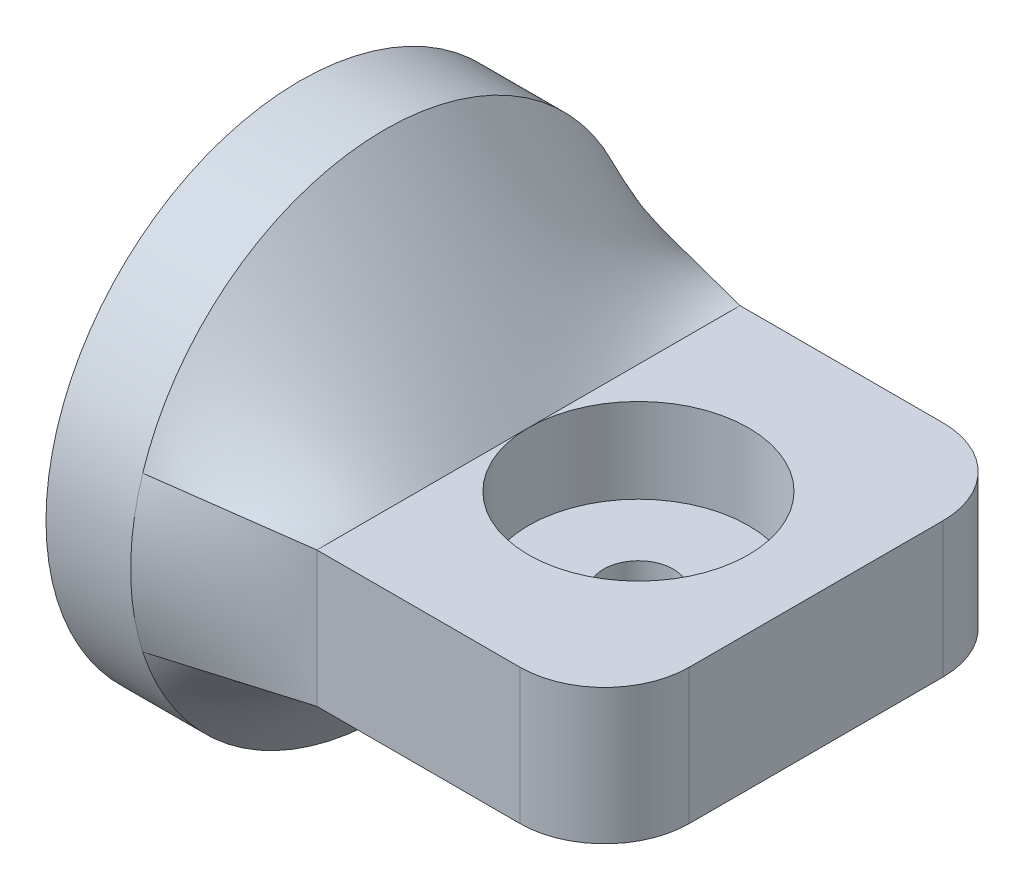
ISO-10303-21;
HEADER;
FILE_DESCRIPTION(('STEP AP214'),'2;1');
FILE_NAME('part.step','',(''),(''),'','','');
FILE_SCHEMA(('AUTOMOTIVE_DESIGN { 1 0 10303 214 1 1 1 1 }'));
ENDSEC;
DATA;
#1=APPLICATION_CONTEXT('core data for automotive mechanical design processes');
#2=APPLICATION_PROTOCOL_DEFINITION('international standard','automotive_design',2000,#1);
#3=PRODUCT_CONTEXT('',#1,'mechanical');
#4=PRODUCT('Part','Part','',(#3));
#5=PRODUCT_RELATED_PRODUCT_CATEGORY('part','',(#4));
#6=PRODUCT_DEFINITION_FORMATION('','',#4);
#7=PRODUCT_DEFINITION_CONTEXT('part definition',#1,'design');
#8=PRODUCT_DEFINITION('design','',#6,#7);
#9=PRODUCT_DEFINITION_SHAPE('','',#8);
#10=(LENGTH_UNIT() NAMED_UNIT(*) SI_UNIT(.MILLI.,.METRE.));
#11=(NAMED_UNIT(*) PLANE_ANGLE_UNIT() SI_UNIT($,.RADIAN.));
#12=(NAMED_UNIT(*) SI_UNIT($,.STERADIAN.) SOLID_ANGLE_UNIT());
#13=UNCERTAINTY_MEASURE_WITH_UNIT(LENGTH_MEASURE(1.E-05),#10,'distance_accuracy_value','');
#14=(GEOMETRIC_REPRESENTATION_CONTEXT(3) GLOBAL_UNCERTAINTY_ASSIGNED_CONTEXT((#13)) GLOBAL_UNIT_ASSIGNED_CONTEXT((#10,
#11,#12)) REPRESENTATION_CONTEXT('',''));
#15=CARTESIAN_POINT('',(0.,0.,0.));
#16=DIRECTION('',(0.,0.,1.));
#17=DIRECTION('',(1.,0.,0.));
#18=AXIS2_PLACEMENT_3D('',#15,#16,#17);
#19=CARTESIAN_POINT('',(0.,4.57163590655676,-14.2863622079899));
#20=CARTESIAN_POINT('',(8.5,4.,-12.5));
#21=CARTESIAN_POINT('',(0.,5.7055256017672,-13.9235175055225));
#22=CARTESIAN_POINT('',(8.5,4.,-11.4583333333333));
#23=CARTESIAN_POINT('',(0.,6.89911447888173,-13.3930431232643));
#24=CARTESIAN_POINT('',(8.5,4.,-10.4166666666667));
#25=CARTESIAN_POINT('',(0.,8.67336070378015,-12.2582894514571));
#26=CARTESIAN_POINT('',(8.5,4.,-8.85416666666664));
#27=CARTESIAN_POINT('',(0.,9.26122646128502,-11.8237084216677));
#28=CARTESIAN_POINT('',(8.5,4.,-8.3333333333333));
#29=CARTESIAN_POINT('',(0.,10.4020192769266,-10.8336693400836));
#30=CARTESIAN_POINT('',(8.5,4.,-7.29166666666663));
#31=CARTESIAN_POINT('',(0.,10.9548679631655,-10.2780926705076));
#32=CARTESIAN_POINT('',(8.5,4.,-6.77083333333329));
#33=CARTESIAN_POINT('',(0.,11.9921816174558,-9.0463197537942));
#34=CARTESIAN_POINT('',(8.5,4.,-5.72916666666662));
#35=CARTESIAN_POINT('',(0.,12.4764973655237,-8.37003816509403));
#36=CARTESIAN_POINT('',(8.5,4.,-5.20833333333329));
#37=CARTESIAN_POINT('',(0.,13.3411278419852,-6.90903996955136));
#38=CARTESIAN_POINT('',(8.5,4.,-4.16666666666661));
#39=CARTESIAN_POINT('',(0.,13.7212416445136,-6.1243184411742));
#40=CARTESIAN_POINT('',(8.5,4.,-3.64583333333328));
#41=CARTESIAN_POINT('',(0.,14.3450405533472,-4.47208677899548));
#42=CARTESIAN_POINT('',(8.5,4.,-2.60416666666661));
#43=CARTESIAN_POINT('',(0.,14.588526725894,-3.60468363324245));
#44=CARTESIAN_POINT('',(8.5,4.,-2.08333333333327));
#45=CARTESIAN_POINT('',(0.,14.9160691770496,-1.82475654084594));
#46=CARTESIAN_POINT('',(8.5,4.,-1.0416666666666));
#47=CARTESIAN_POINT('',(0.,15.,-0.912440474840668));
#48=CARTESIAN_POINT('',(8.5,4.,-0.520833333333269));
#49=CARTESIAN_POINT('',(0.,15.,0.912440474840669));
#50=CARTESIAN_POINT('',(8.5,4.,0.520833333333398));
#51=CARTESIAN_POINT('',(0.,14.9160691770496,1.82475654084594));
#52=CARTESIAN_POINT('',(8.5,4.,1.04166666666673));
#53=CARTESIAN_POINT('',(0.,14.588526725894,3.60468363324245));
#54=CARTESIAN_POINT('',(8.5,4.,2.0833333333334));
#55=CARTESIAN_POINT('',(0.,14.3450405533472,4.47208677899549));
#56=CARTESIAN_POINT('',(8.5,4.,2.60416666666673));
#57=CARTESIAN_POINT('',(0.,13.7212416445136,6.1243184411742));
#58=CARTESIAN_POINT('',(8.5,4.,3.6458333333334));
#59=CARTESIAN_POINT('',(0.,13.3411278419852,6.90903996955136));
#60=CARTESIAN_POINT('',(8.5,4.,4.16666666666673));
#61=CARTESIAN_POINT('',(0.,12.4764973655237,8.37003816509402));
#62=CARTESIAN_POINT('',(8.5,4.,5.20833333333339));
#63=CARTESIAN_POINT('',(0.,11.9921816174558,9.04631975379419));
#64=CARTESIAN_POINT('',(8.5,4.,5.72916666666672));
#65=CARTESIAN_POINT('',(0.,10.9548679631655,10.2780926705076));
#66=CARTESIAN_POINT('',(8.5,4.,6.77083333333338));
#67=CARTESIAN_POINT('',(0.,10.4020192769266,10.8336693400836));
#68=CARTESIAN_POINT('',(8.5,4.,7.29166666666671));
#69=CARTESIAN_POINT('',(0.,9.26122646128502,11.8237084216677));
#70=CARTESIAN_POINT('',(8.5,4.,8.33333333333337));
#71=CARTESIAN_POINT('',(0.,8.67336070378015,12.2582894514571));
#72=CARTESIAN_POINT('',(8.5,4.,8.85416666666671));
#73=CARTESIAN_POINT('',(0.,6.89911447888173,13.3930431232642));
#74=CARTESIAN_POINT('',(8.5,4.,10.4166666666667));
#75=CARTESIAN_POINT('',(0.,5.7055256017672,13.9235175055225));
#76=CARTESIAN_POINT('',(8.5,4.,11.4583333333333));
#77=CARTESIAN_POINT('',(0.,4.57163590655676,14.2863622079899));
#78=CARTESIAN_POINT('',(8.5,4.,12.5));
#79=B_SPLINE_SURFACE_WITH_KNOTS('',3,1,((#19,#20),(#21,#22),(#23,#24),(#25,#26),(#27,#28),(#29,
#30),(#31,#32),(#33,#34),(#35,#36),(#37,#38),(#39,#40),(#41,#42),(#43,#44),(#45,#46),(#47,#48),
(#49,#50),(#51,#52),(#53,#54),(#55,#56),(#57,#58),(#59,#60),(#61,#62),(#63,#64),(#65,#66),(#67,
#68),(#69,#70),(#71,#72),(#73,#74),(#75,#76),(#77,#78)),.UNSPECIFIED.,.F.,.F.,.F.,(4,2,2,2,2,2,
2,2,2,2,2,2,2,2,4),(2,2),(0.,0.125,0.1875,0.25,0.3125,0.375,0.4375,0.5,0.5625,0.625,0.6875,0.75,
0.8125,0.875,1.),(0.,1.),.UNSPECIFIED.);
#80=CARTESIAN_POINT('',(0.,0.,0.));
#81=DIRECTION('',(1.,0.,0.));
#82=DIRECTION('',(0.,0.,-1.));
#83=AXIS2_PLACEMENT_3D('',#80,#81,#82);
#84=CIRCLE('',#83,15.);
#85=CARTESIAN_POINT('',(0.,4.57182275983477,-14.2869402435558));
#86=VERTEX_POINT('',#85);
#87=CARTESIAN_POINT('',(0.,4.57183334503121,14.2869729234421));
#88=VERTEX_POINT('',#87);
#89=EDGE_CURVE('E141',#86,#88,#84,.T.);
#90=DIRECTION('',(0.976509386412931,-0.0656715092192166,-0.20522346631005));
#91=VECTOR('',#90,1.);
#92=CARTESIAN_POINT('',(4.25,4.28581795327838,13.3931811039949));
#93=LINE('',#92,#91);
#94=CARTESIAN_POINT('',(8.5,4.,12.5));
#95=VERTEX_POINT('',#94);
#96=EDGE_CURVE('E162',#88,#95,#93,.T.);
#97=DIRECTION('',(0.,0.,1.));
#98=VECTOR('',#97,1.);
#99=CARTESIAN_POINT('',(8.5,4.,12.5));
#100=LINE('',#99,#98);
#101=CARTESIAN_POINT('',(8.5,4.,0.));
#102=VERTEX_POINT('',#101);
#103=EDGE_CURVE('E312',#102,#95,#100,.T.);
#104=CARTESIAN_POINT('',(8.5,4.,-12.5));
#105=VERTEX_POINT('',#104);
#106=EDGE_CURVE('E273',#105,#102,#100,.T.);
#107=DIRECTION('',(-0.976509386412931,0.065671509219216,-0.20522346631005));
#108=VECTOR('',#107,1.);
#109=CARTESIAN_POINT('',(4.25,4.28581795327838,-13.3931811039949));
#110=LINE('',#109,#108);
#111=EDGE_CURVE('E165',#105,#86,#110,.T.);
#112=ORIENTED_EDGE('',*,*,#89,.T.);
#113=ORIENTED_EDGE('',*,*,#96,.T.);
#114=ORIENTED_EDGE('',*,*,#103,.F.);
#115=ORIENTED_EDGE('',*,*,#106,.F.);
#116=ORIENTED_EDGE('',*,*,#111,.T.);
#117=EDGE_LOOP('',(#112,#113,#114,#115,#116));
#118=FACE_BOUND('',#117,.T.);
#119=ADVANCED_FACE('F68',(#118),#79,.T.);
#120=CARTESIAN_POINT('',(0.,4.57163590655675,14.2863622079899));
#121=CARTESIAN_POINT('',(8.5,4.,12.5));
#122=CARTESIAN_POINT('',(0.,3.84594650162207,14.518582817569));
#123=CARTESIAN_POINT('',(8.5,3.33333333333333,12.5));
#124=CARTESIAN_POINT('',(0.,3.09372515234938,14.6979828288197));
#125=CARTESIAN_POINT('',(8.5,2.66666666666667,12.5));
#126=CARTESIAN_POINT('',(0.,1.56095463943546,14.9387166506424));
#127=CARTESIAN_POINT('',(8.5,1.33333333333333,12.5));
#128=CARTESIAN_POINT('',(0.,0.780505935508361,15.));
#129=CARTESIAN_POINT('',(8.5,0.666666666666664,12.5));
#130=CARTESIAN_POINT('',(0.,-0.780505935508356,15.));
#131=CARTESIAN_POINT('',(8.5,-0.666666666666669,12.5));
#132=CARTESIAN_POINT('',(0.,-1.56095463943546,14.9387166506425));
#133=CARTESIAN_POINT('',(8.5,-1.33333333333334,12.5));
#134=CARTESIAN_POINT('',(0.,-3.09372515234938,14.6979828288197));
#135=CARTESIAN_POINT('',(8.5,-2.66666666666667,12.5));
#136=CARTESIAN_POINT('',(0.,-3.84594650162206,14.518582817569));
#137=CARTESIAN_POINT('',(8.5,-3.33333333333333,12.5));
#138=CARTESIAN_POINT('',(0.,-4.57163590655675,14.2863622079899));
#139=CARTESIAN_POINT('',(8.5,-4.,12.5));
#140=B_SPLINE_SURFACE_WITH_KNOTS('',3,1,((#120,#121),(#122,#123),(#124,#125),(#126,#127),(#128,
#129),(#130,#131),(#132,#133),(#134,#135),(#136,#137),(#138,#139)),.UNSPECIFIED.,.F.,.F.,.F.,(4,
2,2,2,4),(2,2),(0.,0.25,0.5,0.75,1.),(0.,1.),.UNSPECIFIED.);
#141=CARTESIAN_POINT('',(0.,-4.5718211235196,14.2869352396566));
#142=VERTEX_POINT('',#141);
#143=EDGE_CURVE('E137',#88,#142,#84,.T.);
#144=DIRECTION('',(0.976509386412931,0.0656715092192154,-0.205223466310051));
#145=VECTOR('',#144,1.);
#146=CARTESIAN_POINT('',(4.25,-4.28581795327838,13.3931811039949));
#147=LINE('',#146,#145);
#148=CARTESIAN_POINT('',(8.5,-4.,12.5));
#149=VERTEX_POINT('',#148);
#150=EDGE_CURVE('E175',#142,#149,#147,.T.);
#151=DIRECTION('',(0.,-1.,0.));
#152=VECTOR('',#151,1.);
#153=CARTESIAN_POINT('',(8.5,-4.,12.5));
#154=LINE('',#153,#152);
#155=EDGE_CURVE('E172',#95,#149,#154,.T.);
#156=ORIENTED_EDGE('',*,*,#143,.T.);
#157=ORIENTED_EDGE('',*,*,#150,.T.);
#158=ORIENTED_EDGE('',*,*,#155,.F.);
#159=ORIENTED_EDGE('',*,*,#96,.F.);
#160=EDGE_LOOP('',(#156,#157,#158,#159));
#161=FACE_BOUND('',#160,.T.);
#162=ADVANCED_FACE('F170',(#161),#140,.T.);
#163=CARTESIAN_POINT('',(0.,-4.57163590655676,-14.2863622079899));
#164=CARTESIAN_POINT('',(8.5,-4.,-12.5));
#165=CARTESIAN_POINT('',(0.,-3.84594650162207,-14.518582817569));
#166=CARTESIAN_POINT('',(8.5,-3.33333333333333,-12.5));
#167=CARTESIAN_POINT('',(0.,-3.09372515234939,-14.6979828288197));
#168=CARTESIAN_POINT('',(8.5,-2.66666666666667,-12.5));
#169=CARTESIAN_POINT('',(0.,-1.56095463943547,-14.9387166506424));
#170=CARTESIAN_POINT('',(8.5,-1.33333333333333,-12.5));
#171=CARTESIAN_POINT('',(0.,-0.780505935508362,-15.));
#172=CARTESIAN_POINT('',(8.5,-0.666666666666665,-12.5));
#173=CARTESIAN_POINT('',(0.,0.780505935508358,-15.));
#174=CARTESIAN_POINT('',(8.5,0.666666666666668,-12.5));
#175=CARTESIAN_POINT('',(0.,1.56095463943546,-14.9387166506424));
#176=CARTESIAN_POINT('',(8.5,1.33333333333333,-12.5));
#177=CARTESIAN_POINT('',(0.,3.09372515234938,-14.6979828288197));
#178=CARTESIAN_POINT('',(8.5,2.66666666666667,-12.5));
#179=CARTESIAN_POINT('',(0.,3.84594650162207,-14.518582817569));
#180=CARTESIAN_POINT('',(8.5,3.33333333333333,-12.5));
#181=CARTESIAN_POINT('',(0.,4.57163590655676,-14.2863622079899));
#182=CARTESIAN_POINT('',(8.5,4.,-12.5));
#183=B_SPLINE_SURFACE_WITH_KNOTS('',3,1,((#163,#164),(#165,#166),(#167,#168),(#169,#170),(#171,
#172),(#173,#174),(#175,#176),(#177,#178),(#179,#180),(#181,#182)),.UNSPECIFIED.,.F.,.F.,.F.,(4,
2,2,2,4),(2,2),(0.,0.25,0.5,0.75,1.),(0.,1.),.UNSPECIFIED.);
#184=CARTESIAN_POINT('',(0.,-4.57183170509388,-14.2869679122693));
#185=VERTEX_POINT('',#184);
#186=EDGE_CURVE('E72',#185,#86,#84,.T.);
#187=DIRECTION('',(0.,1.,0.));
#188=VECTOR('',#187,1.);
#189=CARTESIAN_POINT('',(8.5,-4.,-12.5));
#190=LINE('',#189,#188);
#191=CARTESIAN_POINT('',(8.5,-4.,-12.5));
#192=VERTEX_POINT('',#191);
#193=EDGE_CURVE('E304',#192,#105,#190,.T.);
#194=DIRECTION('',(0.976509386412931,0.0656715092192168,0.20522346631005));
#195=VECTOR('',#194,1.);
#196=CARTESIAN_POINT('',(4.25,-4.28581795327838,-13.3931811039949));
#197=LINE('',#196,#195);
#198=EDGE_CURVE('E179',#185,#192,#197,.T.);
#199=ORIENTED_EDGE('',*,*,#186,.T.);
#200=ORIENTED_EDGE('',*,*,#111,.F.);
#201=ORIENTED_EDGE('',*,*,#193,.F.);
#202=ORIENTED_EDGE('',*,*,#198,.F.);
#203=EDGE_LOOP('',(#199,#200,#201,#202));
#204=FACE_BOUND('',#203,.T.);
#205=ADVANCED_FACE('F204',(#204),#183,.T.);
#206=CARTESIAN_POINT('',(0.,-4.57163590655675,14.2863622079899));
#207=CARTESIAN_POINT('',(8.5,-4.,12.5));
#208=CARTESIAN_POINT('',(0.,-5.7055256017672,13.9235175055225));
#209=CARTESIAN_POINT('',(8.5,-4.,11.4583333333333));
#210=CARTESIAN_POINT('',(0.,-6.89911447888173,13.3930431232643));
#211=CARTESIAN_POINT('',(8.5,-4.,10.4166666666667));
#212=CARTESIAN_POINT('',(0.,-8.67336070378015,12.2582894514571));
#213=CARTESIAN_POINT('',(8.5,-4.,8.85416666666666));
#214=CARTESIAN_POINT('',(0.,-9.26122646128502,11.8237084216677));
#215=CARTESIAN_POINT('',(8.5,-4.,8.33333333333333));
#216=CARTESIAN_POINT('',(0.,-10.4020192769266,10.8336693400837));
#217=CARTESIAN_POINT('',(8.5,-4.,7.29166666666666));
#218=CARTESIAN_POINT('',(0.,-10.9548679631655,10.2780926705076));
#219=CARTESIAN_POINT('',(8.5,-4.,6.77083333333333));
#220=CARTESIAN_POINT('',(0.,-11.9921816174558,9.0463197537942));
#221=CARTESIAN_POINT('',(8.5,-4.,5.72916666666666));
#222=CARTESIAN_POINT('',(0.,-12.4764973655237,8.37003816509403));
#223=CARTESIAN_POINT('',(8.5,-4.,5.20833333333333));
#224=CARTESIAN_POINT('',(0.,-13.3411278419852,6.90903996955137));
#225=CARTESIAN_POINT('',(8.5,-4.,4.16666666666666));
#226=CARTESIAN_POINT('',(0.,-13.7212416445136,6.1243184411742));
#227=CARTESIAN_POINT('',(8.5,-4.,3.64583333333332));
#228=CARTESIAN_POINT('',(0.,-14.3450405533472,4.47208677899549));
#229=CARTESIAN_POINT('',(8.5,-4.,2.60416666666666));
#230=CARTESIAN_POINT('',(0.,-14.588526725894,3.60468363324246));
#231=CARTESIAN_POINT('',(8.5,-4.,2.08333333333332));
#232=CARTESIAN_POINT('',(0.,-14.9160691770496,1.82475654084595));
#233=CARTESIAN_POINT('',(8.5,-4.,1.04166666666666));
#234=CARTESIAN_POINT('',(0.,-15.,0.912440474840675));
#235=CARTESIAN_POINT('',(8.5,-4.,0.520833333333325));
#236=CARTESIAN_POINT('',(0.,-15.,-0.912440474840661));
#237=CARTESIAN_POINT('',(8.5,-4.,-0.520833333333344));
#238=CARTESIAN_POINT('',(0.,-14.9160691770496,-1.82475654084594));
#239=CARTESIAN_POINT('',(8.5,-4.,-1.04166666666668));
#240=CARTESIAN_POINT('',(0.,-14.588526725894,-3.60468363324244));
#241=CARTESIAN_POINT('',(8.5,-4.,-2.08333333333335));
#242=CARTESIAN_POINT('',(0.,-14.3450405533472,-4.47208677899548));
#243=CARTESIAN_POINT('',(8.5,-4.,-2.60416666666668));
#244=CARTESIAN_POINT('',(0.,-13.7212416445136,-6.12431844117419));
#245=CARTESIAN_POINT('',(8.5,-4.,-3.64583333333335));
#246=CARTESIAN_POINT('',(0.,-13.3411278419852,-6.90903996955135));
#247=CARTESIAN_POINT('',(8.5,-4.,-4.16666666666668));
#248=CARTESIAN_POINT('',(0.,-12.4764973655237,-8.37003816509402));
#249=CARTESIAN_POINT('',(8.5,-4.,-5.20833333333335));
#250=CARTESIAN_POINT('',(0.,-11.9921816174558,-9.04631975379419));
#251=CARTESIAN_POINT('',(8.5,-4.,-5.72916666666668));
#252=CARTESIAN_POINT('',(0.,-10.9548679631655,-10.2780926705076));
#253=CARTESIAN_POINT('',(8.5,-4.,-6.77083333333335));
#254=CARTESIAN_POINT('',(0.,-10.4020192769266,-10.8336693400836));
#255=CARTESIAN_POINT('',(8.5,-4.,-7.29166666666668));
#256=CARTESIAN_POINT('',(0.,-9.26122646128503,-11.8237084216677));
#257=CARTESIAN_POINT('',(8.5,-4.,-8.33333333333334));
#258=CARTESIAN_POINT('',(0.,-8.67336070378015,-12.2582894514571));
#259=CARTESIAN_POINT('',(8.5,-4.,-8.85416666666668));
#260=CARTESIAN_POINT('',(0.,-6.89911447888174,-13.3930431232642));
#261=CARTESIAN_POINT('',(8.5,-4.,-10.4166666666667));
#262=CARTESIAN_POINT('',(0.,-5.70552560176721,-13.9235175055225));
#263=CARTESIAN_POINT('',(8.5,-4.,-11.4583333333333));
#264=CARTESIAN_POINT('',(0.,-4.57163590655676,-14.2863622079899));
#265=CARTESIAN_POINT('',(8.5,-4.,-12.5));
#266=B_SPLINE_SURFACE_WITH_KNOTS('',3,1,((#206,#207),(#208,#209),(#210,#211),(#212,#213),(#214,
#215),(#216,#217),(#218,#219),(#220,#221),(#222,#223),(#224,#225),(#226,#227),(#228,#229),(#230,
#231),(#232,#233),(#234,#235),(#236,#237),(#238,#239),(#240,#241),(#242,#243),(#244,#245),(#246,
#247),(#248,#249),(#250,#251),(#252,#253),(#254,#255),(#256,#257),(#258,#259),(#260,#261),(#262,
#263),(#264,#265)),.UNSPECIFIED.,.F.,.F.,.F.,(4,2,2,2,2,2,2,2,2,2,2,2,2,2,4),(2,2),(0.,0.125,
0.1875,0.25,0.3125,0.375,0.4375,0.5,0.5625,0.625,0.6875,0.75,0.8125,0.875,1.),(0.,1.),.UNSPECIFIED.);
#267=EDGE_CURVE('E145',#142,#185,#84,.T.);
#268=DIRECTION('',(0.,0.,-1.));
#269=VECTOR('',#268,1.);
#270=CARTESIAN_POINT('',(8.5,-4.,12.5));
#271=LINE('',#270,#269);
#272=EDGE_CURVE('E233',#149,#192,#271,.T.);
#273=ORIENTED_EDGE('',*,*,#267,.T.);
#274=ORIENTED_EDGE('',*,*,#198,.T.);
#275=ORIENTED_EDGE('',*,*,#272,.F.);
#276=ORIENTED_EDGE('',*,*,#150,.F.);
#277=EDGE_LOOP('',(#273,#274,#275,#276));
#278=FACE_BOUND('',#277,.T.);
#279=ADVANCED_FACE('F296',(#278),#266,.T.);
#280=CARTESIAN_POINT('',(25.5,-4.,-12.5));
#281=DIRECTION('',(0.,0.,1.));
#282=DIRECTION('',(1.,0.,0.));
#283=AXIS2_PLACEMENT_3D('',#280,#281,#282);
#284=PLANE('',#283);
#285=DIRECTION('',(-1.,0.,0.));
#286=VECTOR('',#285,1.);
#287=CARTESIAN_POINT('',(25.5,4.,-12.5));
#288=LINE('',#287,#286);
#289=CARTESIAN_POINT('',(20.5,4.,-12.5));
#290=VERTEX_POINT('',#289);
#291=EDGE_CURVE('E153',#290,#105,#288,.T.);
#292=ORIENTED_EDGE('',*,*,#291,.F.);
#293=DIRECTION('',(0.,1.,0.));
#294=VECTOR('',#293,1.);
#295=CARTESIAN_POINT('',(20.5,-4.,-12.5));
#296=LINE('',#295,#294);
#297=CARTESIAN_POINT('',(20.5,-4.,-12.5));
#298=VERTEX_POINT('',#297);
#299=EDGE_CURVE('E12',#290,#298,#296,.F.);
#300=ORIENTED_EDGE('',*,*,#299,.T.);
#301=DIRECTION('',(-1.,0.,0.));
#302=VECTOR('',#301,1.);
#303=CARTESIAN_POINT('',(25.5,-4.,-12.5));
#304=LINE('',#303,#302);
#305=EDGE_CURVE('E252',#298,#192,#304,.T.);
#306=ORIENTED_EDGE('',*,*,#305,.T.);
#307=ORIENTED_EDGE('',*,*,#193,.T.);
#308=EDGE_LOOP('',(#292,#300,#306,#307));
#309=FACE_BOUND('',#308,.T.);
#310=ADVANCED_FACE('F292',(#309),#284,.F.);
#311=CARTESIAN_POINT('',(25.5,4.,12.5));
#312=DIRECTION('',(0.,-1.,0.));
#313=DIRECTION('',(0.,0.,-1.));
#314=AXIS2_PLACEMENT_3D('',#311,#312,#313);
#315=PLANE('',#314);
#316=ORIENTED_EDGE('',*,*,#106,.T.);
#317=CARTESIAN_POINT('',(15.,4.,0.));
#318=DIRECTION('',(0.,1.,0.));
#319=DIRECTION('',(0.,0.,1.));
#320=AXIS2_PLACEMENT_3D('',#317,#318,#319);
#321=CIRCLE('',#320,6.5);
#322=EDGE_CURVE('E85',#102,#102,#321,.T.);
#323=ORIENTED_EDGE('',*,*,#322,.F.);
#324=ORIENTED_EDGE('',*,*,#103,.T.);
#325=DIRECTION('',(-1.,0.,0.));
#326=VECTOR('',#325,1.);
#327=CARTESIAN_POINT('',(25.5,4.,12.5));
#328=LINE('',#327,#326);
#329=CARTESIAN_POINT('',(20.5,4.,12.5));
#330=VERTEX_POINT('',#329);
#331=EDGE_CURVE('E251',#330,#95,#328,.T.);
#332=ORIENTED_EDGE('',*,*,#331,.F.);
#333=CARTESIAN_POINT('',(20.5,4.,7.5));
#334=DIRECTION('',(0.,-1.,0.));
#335=DIRECTION('',(0.,0.,-1.));
#336=AXIS2_PLACEMENT_3D('',#333,#334,#335);
#337=CIRCLE('',#336,5.);
#338=CARTESIAN_POINT('',(25.5,4.,7.5));
#339=VERTEX_POINT('',#338);
#340=EDGE_CURVE('E79',#330,#339,#337,.F.);
#341=ORIENTED_EDGE('',*,*,#340,.T.);
#342=DIRECTION('',(0.,0.,1.));
#343=VECTOR('',#342,1.);
#344=CARTESIAN_POINT('',(25.5,4.,12.5));
#345=LINE('',#344,#343);
#346=CARTESIAN_POINT('',(25.5,4.,-7.5));
#347=VERTEX_POINT('',#346);
#348=EDGE_CURVE('E413',#347,#339,#345,.T.);
#349=ORIENTED_EDGE('',*,*,#348,.F.);
#350=CARTESIAN_POINT('',(20.5,4.,-7.5));
#351=DIRECTION('',(0.,-1.,0.));
#352=DIRECTION('',(0.,0.,-1.));
#353=AXIS2_PLACEMENT_3D('',#350,#351,#352);
#354=CIRCLE('',#353,5.);
#355=EDGE_CURVE('E92',#347,#290,#354,.F.);
#356=ORIENTED_EDGE('',*,*,#355,.T.);
#357=ORIENTED_EDGE('',*,*,#291,.T.);
#358=EDGE_LOOP('',(#316,#323,#324,#332,#341,#349,#356,#357));
#359=FACE_BOUND('',#358,.T.);
#360=ADVANCED_FACE('F281',(#359),#315,.F.);
#361=CARTESIAN_POINT('',(25.5,-4.,12.5));
#362=DIRECTION('',(0.,0.,-1.));
#363=DIRECTION('',(-1.,0.,0.));
#364=AXIS2_PLACEMENT_3D('',#361,#362,#363);
#365=PLANE('',#364);
#366=DIRECTION('',(-1.,0.,0.));
#367=VECTOR('',#366,1.);
#368=CARTESIAN_POINT('',(25.5,-4.,12.5));
#369=LINE('',#368,#367);
#370=CARTESIAN_POINT('',(20.5,-4.,12.5));
#371=VERTEX_POINT('',#370);
#372=EDGE_CURVE('E247',#371,#149,#369,.T.);
#373=ORIENTED_EDGE('',*,*,#372,.F.);
#374=DIRECTION('',(0.,-1.,0.));
#375=VECTOR('',#374,1.);
#376=CARTESIAN_POINT('',(20.5,-4.,12.5));
#377=LINE('',#376,#375);
#378=EDGE_CURVE('E262',#371,#330,#377,.F.);
#379=ORIENTED_EDGE('',*,*,#378,.T.);
#380=ORIENTED_EDGE('',*,*,#331,.T.);
#381=ORIENTED_EDGE('',*,*,#155,.T.);
#382=EDGE_LOOP('',(#373,#379,#380,#381));
#383=FACE_BOUND('',#382,.T.);
#384=ADVANCED_FACE('F291',(#383),#365,.F.);
#385=CARTESIAN_POINT('',(25.5,-4.,12.5));
#386=DIRECTION('',(0.,1.,0.));
#387=DIRECTION('',(0.,0.,1.));
#388=AXIS2_PLACEMENT_3D('',#385,#386,#387);
#389=PLANE('',#388);
#390=CARTESIAN_POINT('',(15.,-4.,0.));
#391=DIRECTION('',(0.,1.,0.));
#392=DIRECTION('',(0.,0.,1.));
#393=AXIS2_PLACEMENT_3D('',#390,#391,#392);
#394=CIRCLE('',#393,2.05);
#395=CARTESIAN_POINT('',(15.,-4.,2.05));
#396=VERTEX_POINT('',#395);
#397=EDGE_CURVE('E579',#396,#396,#394,.T.);
#398=ORIENTED_EDGE('',*,*,#397,.T.);
#399=EDGE_LOOP('',(#398));
#400=FACE_BOUND('',#399,.T.);
#401=DIRECTION('',(0.,0.,-1.));
#402=VECTOR('',#401,1.);
#403=CARTESIAN_POINT('',(25.5,-4.,12.5));
#404=LINE('',#403,#402);
#405=CARTESIAN_POINT('',(25.5,-4.,7.5));
#406=VERTEX_POINT('',#405);
#407=CARTESIAN_POINT('',(25.5,-4.,-7.5));
#408=VERTEX_POINT('',#407);
#409=EDGE_CURVE('E327',#406,#408,#404,.T.);
#410=ORIENTED_EDGE('',*,*,#409,.F.);
#411=CARTESIAN_POINT('',(20.5,-4.,7.5));
#412=DIRECTION('',(0.,1.,0.));
#413=DIRECTION('',(0.,0.,1.));
#414=AXIS2_PLACEMENT_3D('',#411,#412,#413);
#415=CIRCLE('',#414,5.);
#416=EDGE_CURVE('E258',#406,#371,#415,.F.);
#417=ORIENTED_EDGE('',*,*,#416,.T.);
#418=ORIENTED_EDGE('',*,*,#372,.T.);
#419=ORIENTED_EDGE('',*,*,#272,.T.);
#420=ORIENTED_EDGE('',*,*,#305,.F.);
#421=CARTESIAN_POINT('',(20.5,-4.,-7.5));
#422=DIRECTION('',(0.,1.,0.));
#423=DIRECTION('',(0.,0.,1.));
#424=AXIS2_PLACEMENT_3D('',#421,#422,#423);
#425=CIRCLE('',#424,5.);
#426=EDGE_CURVE('E255',#298,#408,#425,.F.);
#427=ORIENTED_EDGE('',*,*,#426,.T.);
#428=EDGE_LOOP('',(#410,#417,#418,#419,#420,#427));
#429=FACE_BOUND('',#428,.T.);
#430=ADVANCED_FACE('F414',(#400,#429),#389,.F.);
#431=CARTESIAN_POINT('',(25.5,0.,0.));
#432=DIRECTION('',(-1.,0.,0.));
#433=DIRECTION('',(0.,0.,1.));
#434=AXIS2_PLACEMENT_3D('',#431,#432,#433);
#435=PLANE('',#434);
#436=ORIENTED_EDGE('',*,*,#348,.T.);
#437=DIRECTION('',(0.,-1.,0.));
#438=VECTOR('',#437,1.);
#439=CARTESIAN_POINT('',(25.5,0.,7.5));
#440=LINE('',#439,#438);
#441=EDGE_CURVE('E259',#339,#406,#440,.T.);
#442=ORIENTED_EDGE('',*,*,#441,.T.);
#443=ORIENTED_EDGE('',*,*,#409,.T.);
#444=DIRECTION('',(0.,1.,0.));
#445=VECTOR('',#444,1.);
#446=CARTESIAN_POINT('',(25.5,0.,-7.5));
#447=LINE('',#446,#445);
#448=EDGE_CURVE('E238',#408,#347,#447,.T.);
#449=ORIENTED_EDGE('',*,*,#448,.T.);
#450=EDGE_LOOP('',(#436,#442,#443,#449));
#451=FACE_BOUND('',#450,.T.);
#452=ADVANCED_FACE('F411',(#451),#435,.F.);
#453=CARTESIAN_POINT('',(20.5,0.,7.5));
#454=DIRECTION('',(0.,-1.,0.));
#455=DIRECTION('',(0.,0.,-1.));
#456=AXIS2_PLACEMENT_3D('',#453,#454,#455);
#457=CYLINDRICAL_SURFACE('',#456,5.);
#458=ORIENTED_EDGE('',*,*,#340,.F.);
#459=ORIENTED_EDGE('',*,*,#378,.F.);
#460=ORIENTED_EDGE('',*,*,#416,.F.);
#461=ORIENTED_EDGE('',*,*,#441,.F.);
#462=EDGE_LOOP('',(#458,#459,#460,#461));
#463=FACE_BOUND('',#462,.T.);
#464=ADVANCED_FACE('F347',(#463),#457,.T.);
#465=CARTESIAN_POINT('',(20.5,0.,-7.5));
#466=DIRECTION('',(0.,1.,0.));
#467=DIRECTION('',(0.,0.,1.));
#468=AXIS2_PLACEMENT_3D('',#465,#466,#467);
#469=CYLINDRICAL_SURFACE('',#468,5.);
#470=ORIENTED_EDGE('',*,*,#426,.F.);
#471=ORIENTED_EDGE('',*,*,#299,.F.);
#472=ORIENTED_EDGE('',*,*,#355,.F.);
#473=ORIENTED_EDGE('',*,*,#448,.F.);
#474=EDGE_LOOP('',(#470,#471,#472,#473));
#475=FACE_BOUND('',#474,.T.);
#476=ADVANCED_FACE('F70',(#475),#469,.T.);
#477=CARTESIAN_POINT('',(15.,4.,0.));
#478=DIRECTION('',(0.,-1.,0.));
#479=DIRECTION('',(0.,0.,-1.));
#480=AXIS2_PLACEMENT_3D('',#477,#478,#479);
#481=CYLINDRICAL_SURFACE('',#480,6.5);
#482=ORIENTED_EDGE('',*,*,#322,.T.);
#483=EDGE_LOOP('',(#482));
#484=FACE_BOUND('',#483,.T.);
#485=CARTESIAN_POINT('',(15.,-1.,0.));
#486=DIRECTION('',(0.,1.,0.));
#487=DIRECTION('',(0.,0.,1.));
#488=AXIS2_PLACEMENT_3D('',#485,#486,#487);
#489=CIRCLE('',#488,6.5);
#490=CARTESIAN_POINT('',(15.,-1.,6.5));
#491=VERTEX_POINT('',#490);
#492=EDGE_CURVE('E418',#491,#491,#489,.T.);
#493=ORIENTED_EDGE('',*,*,#492,.F.);
#494=EDGE_LOOP('',(#493));
#495=FACE_BOUND('',#494,.T.);
#496=ADVANCED_FACE('F460',(#484,#495),#481,.F.);
#497=CARTESIAN_POINT('',(15.,-1.,0.));
#498=DIRECTION('',(0.,1.,0.));
#499=DIRECTION('',(0.,0.,1.));
#500=AXIS2_PLACEMENT_3D('',#497,#498,#499);
#501=PLANE('',#500);
#502=CARTESIAN_POINT('',(15.,-1.,0.));
#503=DIRECTION('',(0.,1.,0.));
#504=DIRECTION('',(0.,0.,1.));
#505=AXIS2_PLACEMENT_3D('',#502,#503,#504);
#506=CIRCLE('',#505,2.05);
#507=CARTESIAN_POINT('',(15.,-1.,2.05));
#508=VERTEX_POINT('',#507);
#509=EDGE_CURVE('E582',#508,#508,#506,.T.);
#510=ORIENTED_EDGE('',*,*,#509,.F.);
#511=EDGE_LOOP('',(#510));
#512=FACE_BOUND('',#511,.T.);
#513=ORIENTED_EDGE('',*,*,#492,.T.);
#514=EDGE_LOOP('',(#513));
#515=FACE_BOUND('',#514,.T.);
#516=ADVANCED_FACE('F457',(#512,#515),#501,.T.);
#517=CARTESIAN_POINT('',(-5.,0.,0.));
#518=DIRECTION('',(-1.,0.,0.));
#519=DIRECTION('',(0.,0.,1.));
#520=AXIS2_PLACEMENT_3D('',#517,#518,#519);
#521=PLANE('',#520);
#522=CARTESIAN_POINT('',(-5.,0.,0.));
#523=DIRECTION('',(-1.,0.,0.));
#524=DIRECTION('',(0.,0.,1.));
#525=AXIS2_PLACEMENT_3D('',#522,#523,#524);
#526=CIRCLE('',#525,15.);
#527=CARTESIAN_POINT('',(-5.,0.,15.));
#528=VERTEX_POINT('',#527);
#529=EDGE_CURVE('E424',#528,#528,#526,.T.);
#530=ORIENTED_EDGE('',*,*,#529,.T.);
#531=EDGE_LOOP('',(#530));
#532=FACE_BOUND('',#531,.T.);
#533=CARTESIAN_POINT('',(-5.,0.,0.));
#534=DIRECTION('',(-1.,0.,0.));
#535=DIRECTION('',(0.,0.,1.));
#536=AXIS2_PLACEMENT_3D('',#533,#534,#535);
#537=CIRCLE('',#536,6.5);
#538=CARTESIAN_POINT('',(-5.,0.,6.5));
#539=VERTEX_POINT('',#538);
#540=EDGE_CURVE('E429',#539,#539,#537,.T.);
#541=ORIENTED_EDGE('',*,*,#540,.F.);
#542=EDGE_LOOP('',(#541));
#543=FACE_BOUND('',#542,.T.);
#544=ADVANCED_FACE('F454',(#532,#543),#521,.T.);
#545=CARTESIAN_POINT('',(-5.,0.,0.));
#546=DIRECTION('',(1.,0.,0.));
#547=DIRECTION('',(0.,0.,-1.));
#548=AXIS2_PLACEMENT_3D('',#545,#546,#547);
#549=CYLINDRICAL_SURFACE('',#548,15.);
#550=ORIENTED_EDGE('',*,*,#529,.F.);
#551=EDGE_LOOP('',(#550));
#552=FACE_BOUND('',#551,.T.);
#553=ORIENTED_EDGE('',*,*,#89,.F.);
#554=ORIENTED_EDGE('',*,*,#186,.F.);
#555=ORIENTED_EDGE('',*,*,#267,.F.);
#556=ORIENTED_EDGE('',*,*,#143,.F.);
#557=EDGE_LOOP('',(#553,#554,#555,#556));
#558=FACE_BOUND('',#557,.T.);
#559=ADVANCED_FACE('F140',(#552,#558),#549,.T.);
#560=CARTESIAN_POINT('',(-5.,0.,0.));
#561=DIRECTION('',(1.,0.,0.));
#562=DIRECTION('',(0.,0.,-1.));
#563=AXIS2_PLACEMENT_3D('',#560,#561,#562);
#564=CYLINDRICAL_SURFACE('',#563,6.5);
#565=ORIENTED_EDGE('',*,*,#540,.T.);
#566=EDGE_LOOP('',(#565));
#567=FACE_BOUND('',#566,.T.);
#568=CARTESIAN_POINT('',(0.,0.,0.));
#569=DIRECTION('',(-1.,0.,0.));
#570=DIRECTION('',(0.,0.,1.));
#571=AXIS2_PLACEMENT_3D('',#568,#569,#570);
#572=CIRCLE('',#571,6.5);
#573=CARTESIAN_POINT('',(0.,0.,6.5));
#574=VERTEX_POINT('',#573);
#575=EDGE_CURVE('E435',#574,#574,#572,.T.);
#576=ORIENTED_EDGE('',*,*,#575,.F.);
#577=EDGE_LOOP('',(#576));
#578=FACE_BOUND('',#577,.T.);
#579=ADVANCED_FACE('F453',(#567,#578),#564,.F.);
#580=CARTESIAN_POINT('',(0.,0.,0.));
#581=DIRECTION('',(1.,0.,0.));
#582=DIRECTION('',(0.,0.,-1.));
#583=AXIS2_PLACEMENT_3D('',#580,#581,#582);
#584=PLANE('',#583);
#585=ORIENTED_EDGE('',*,*,#575,.T.);
#586=EDGE_LOOP('',(#585));
#587=FACE_BOUND('',#586,.T.);
#588=ADVANCED_FACE('F298',(#587),#584,.F.);
#589=CARTESIAN_POINT('',(15.,-4.,0.));
#590=DIRECTION('',(0.,1.,0.));
#591=DIRECTION('',(0.,0.,1.));
#592=AXIS2_PLACEMENT_3D('',#589,#590,#591);
#593=CYLINDRICAL_SURFACE('',#592,2.05);
#594=ORIENTED_EDGE('',*,*,#397,.F.);
#595=EDGE_LOOP('',(#594));
#596=FACE_BOUND('',#595,.T.);
#597=ORIENTED_EDGE('',*,*,#509,.T.);
#598=EDGE_LOOP('',(#597));
#599=FACE_BOUND('',#598,.T.);
#600=ADVANCED_FACE('F554',(#596,#599),#593,.F.);
#601=CLOSED_SHELL('',(#119,#162,#205,#279,#310,#360,#384,#430,#452,#464,#476,#496,#516,#544,
#559,#579,#588,#600));
#602=MANIFOLD_SOLID_BREP('B2',#601);
#603=ADVANCED_BREP_SHAPE_REPRESENTATION('',(#18,#602),#14);
#604=SHAPE_DEFINITION_REPRESENTATION(#9,#603);
ENDSEC;
END-ISO-10303-21;
